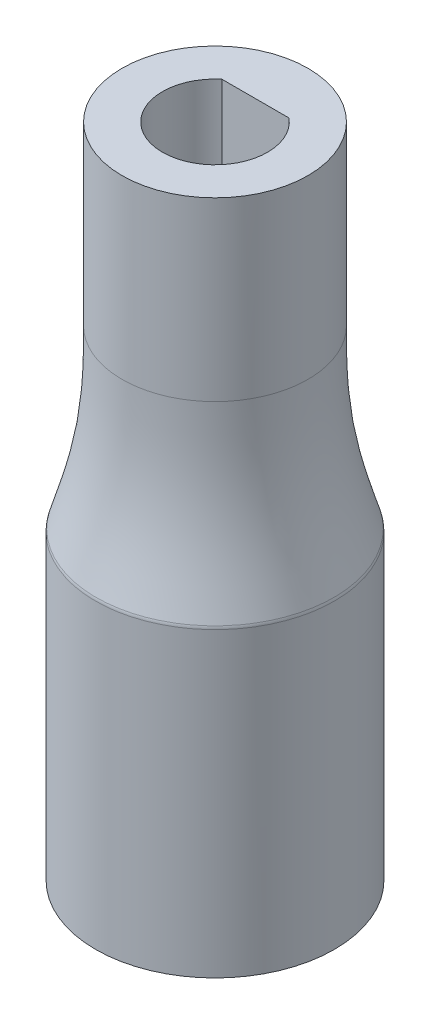
ISO-10303-21;
HEADER;
FILE_DESCRIPTION(('STEP AP214'),'2;1');
FILE_NAME('part.step','',(''),(''),'','','');
FILE_SCHEMA(('AUTOMOTIVE_DESIGN { 1 0 10303 214 1 1 1 1 }'));
ENDSEC;
DATA;
#1=APPLICATION_CONTEXT('core data for automotive mechanical design processes');
#2=APPLICATION_PROTOCOL_DEFINITION('international standard','automotive_design',2000,#1);
#3=PRODUCT_CONTEXT('',#1,'mechanical');
#4=PRODUCT('Part','Part','',(#3));
#5=PRODUCT_RELATED_PRODUCT_CATEGORY('part','',(#4));
#6=PRODUCT_DEFINITION_FORMATION('','',#4);
#7=PRODUCT_DEFINITION_CONTEXT('part definition',#1,'design');
#8=PRODUCT_DEFINITION('design','',#6,#7);
#9=PRODUCT_DEFINITION_SHAPE('','',#8);
#10=(LENGTH_UNIT() NAMED_UNIT(*) SI_UNIT(.MILLI.,.METRE.));
#11=(NAMED_UNIT(*) PLANE_ANGLE_UNIT() SI_UNIT($,.RADIAN.));
#12=(NAMED_UNIT(*) SI_UNIT($,.STERADIAN.) SOLID_ANGLE_UNIT());
#13=UNCERTAINTY_MEASURE_WITH_UNIT(LENGTH_MEASURE(1.E-05),#10,'distance_accuracy_value','');
#14=(GEOMETRIC_REPRESENTATION_CONTEXT(3) GLOBAL_UNCERTAINTY_ASSIGNED_CONTEXT((#13)) GLOBAL_UNIT_ASSIGNED_CONTEXT((#10,
#11,#12)) REPRESENTATION_CONTEXT('',''));
#15=CARTESIAN_POINT('',(0.,0.,0.));
#16=DIRECTION('',(0.,0.,1.));
#17=DIRECTION('',(1.,0.,0.));
#18=AXIS2_PLACEMENT_3D('',#15,#16,#17);
#19=CARTESIAN_POINT('',(0.,15.,0.));
#20=DIRECTION('',(0.,1.,0.));
#21=DIRECTION('',(0.,0.,1.));
#22=AXIS2_PLACEMENT_3D('',#19,#20,#21);
#23=PLANE('',#22);
#24=CARTESIAN_POINT('',(0.,15.,0.));
#25=DIRECTION('',(0.,1.,0.));
#26=DIRECTION('',(0.,0.,1.));
#27=AXIS2_PLACEMENT_3D('',#24,#25,#26);
#28=CIRCLE('',#27,4.6);
#29=CARTESIAN_POINT('',(0.,15.,4.6));
#30=VERTEX_POINT('',#29);
#31=EDGE_CURVE('E81',#30,#30,#28,.T.);
#32=ORIENTED_EDGE('',*,*,#31,.T.);
#33=EDGE_LOOP('',(#32));
#34=FACE_BOUND('',#33,.T.);
#35=DIRECTION('',(1.,0.,0.));
#36=VECTOR('',#35,1.);
#37=CARTESIAN_POINT('',(0.,15.,-2.));
#38=LINE('',#37,#36);
#39=CARTESIAN_POINT('',(-1.66132477258361,15.,-2.));
#40=VERTEX_POINT('',#39);
#41=CARTESIAN_POINT('',(1.66132477258361,15.,-2.));
#42=VERTEX_POINT('',#41);
#43=EDGE_CURVE('E58',#40,#42,#38,.T.);
#44=ORIENTED_EDGE('',*,*,#43,.T.);
#45=CARTESIAN_POINT('',(0.,15.,0.));
#46=DIRECTION('',(0.,1.,0.));
#47=DIRECTION('',(0.,0.,1.));
#48=AXIS2_PLACEMENT_3D('',#45,#46,#47);
#49=CIRCLE('',#48,2.6);
#50=EDGE_CURVE('E75',#40,#42,#49,.T.);
#51=ORIENTED_EDGE('',*,*,#50,.F.);
#52=EDGE_LOOP('',(#44,#51));
#53=FACE_BOUND('',#52,.T.);
#54=ADVANCED_FACE('F37',(#34,#53),#23,.T.);
#55=CARTESIAN_POINT('',(0.,15.,0.));
#56=DIRECTION('',(0.,-1.,0.));
#57=DIRECTION('',(0.,0.,-1.));
#58=AXIS2_PLACEMENT_3D('',#55,#56,#57);
#59=CYLINDRICAL_SURFACE('',#58,4.6);
#60=CARTESIAN_POINT('',(0.,6.26834648038043,-4.6));
#61=CARTESIAN_POINT('',(0.602057564036324,6.26834648038043,-4.6));
#62=CARTESIAN_POINT('',(1.80617269210897,6.26834648038041,-4.36048660927741));
#63=CARTESIAN_POINT('',(3.33737196484058,6.26834648038044,-3.33737196484058));
#64=CARTESIAN_POINT('',(4.36048660927742,6.26834648038043,-1.80617269210897));
#65=CARTESIAN_POINT('',(4.71975669536129,6.26834648038043,0.));
#66=CARTESIAN_POINT('',(4.36048660927741,6.26834648038043,1.80617269210898));
#67=CARTESIAN_POINT('',(3.33737196484058,6.26834648038044,3.33737196484058));
#68=CARTESIAN_POINT('',(1.80617269210899,6.26834648038043,4.36048660927741));
#69=CARTESIAN_POINT('',(0.,6.26834648038044,4.71975669536129));
#70=CARTESIAN_POINT('',(-1.80617269210895,6.26834648038042,4.36048660927741));
#71=CARTESIAN_POINT('',(-3.33737196484059,6.26834648038043,3.33737196484058));
#72=CARTESIAN_POINT('',(-4.3604866092774,6.26834648038042,1.80617269210899));
#73=CARTESIAN_POINT('',(-4.7197566953613,6.26834648038044,0.));
#74=CARTESIAN_POINT('',(-4.36048660927741,6.26834648038042,-1.80617269210896));
#75=CARTESIAN_POINT('',(-3.3373719648406,6.26834648038044,-3.33737196484058));
#76=CARTESIAN_POINT('',(-1.80617269210897,6.26834648038042,-4.36048660927741));
#77=CARTESIAN_POINT('',(-0.602057564036324,6.26834648038044,-4.6));
#78=CARTESIAN_POINT('',(0.,6.26834648038043,-4.6));
#79=B_SPLINE_CURVE_WITH_KNOTS('',3,(#60,#61,#62,#63,#64,#65,#66,#67,#68,#69,#70,#71,#72,#73,#74,
#75,#76,#77,#78),.UNSPECIFIED.,.T.,.F.,(4,1,1,1,1,1,1,1,1,1,1,1,1,1,1,1,4),(0.,
0.392699081698724,0.785398163397448,1.17809724509617,1.5707963267949,1.96349540849362,
2.35619449019234,2.74889357189107,3.14159265358979,3.53429173528852,3.92699081698724,
4.31968989868597,4.71238898038469,5.10508806208341,5.49778714378214,5.89048622548086,
6.28318530717959),.UNSPECIFIED.);
#80=CARTESIAN_POINT('',(0.,6.26834648038043,-4.6));
#81=VERTEX_POINT('',#80);
#82=EDGE_CURVE('E84',#81,#81,#79,.F.);
#83=ORIENTED_EDGE('',*,*,#82,.T.);
#84=EDGE_LOOP('',(#83));
#85=FACE_BOUND('',#84,.T.);
#86=ORIENTED_EDGE('',*,*,#31,.F.);
#87=EDGE_LOOP('',(#86));
#88=FACE_BOUND('',#87,.T.);
#89=ADVANCED_FACE('F97',(#85,#88),#59,.T.);
#90=CARTESIAN_POINT('',(0.,21.9426219830839,-2.));
#91=DIRECTION('',(0.,0.,-1.));
#92=DIRECTION('',(-1.,0.,0.));
#93=AXIS2_PLACEMENT_3D('',#90,#91,#92);
#94=PLANE('',#93);
#95=DIRECTION('',(0.,-1.,0.));
#96=VECTOR('',#95,1.);
#97=CARTESIAN_POINT('',(1.66132477258361,21.9426219830839,-2.));
#98=LINE('',#97,#96);
#99=CARTESIAN_POINT('',(1.66132477258361,0.,-2.));
#100=VERTEX_POINT('',#99);
#101=EDGE_CURVE('E76',#42,#100,#98,.T.);
#102=ORIENTED_EDGE('',*,*,#101,.F.);
#103=ORIENTED_EDGE('',*,*,#43,.F.);
#104=DIRECTION('',(0.,-1.,0.));
#105=VECTOR('',#104,1.);
#106=CARTESIAN_POINT('',(-1.66132477258361,21.9426219830839,-2.));
#107=LINE('',#106,#105);
#108=CARTESIAN_POINT('',(-1.66132477258361,0.,-2.));
#109=VERTEX_POINT('',#108);
#110=EDGE_CURVE('E66',#40,#109,#107,.T.);
#111=ORIENTED_EDGE('',*,*,#110,.T.);
#112=DIRECTION('',(1.,0.,0.));
#113=VECTOR('',#112,1.);
#114=CARTESIAN_POINT('',(0.,0.,-2.));
#115=LINE('',#114,#113);
#116=EDGE_CURVE('E70',#100,#109,#115,.F.);
#117=ORIENTED_EDGE('',*,*,#116,.F.);
#118=EDGE_LOOP('',(#102,#103,#111,#117));
#119=FACE_BOUND('',#118,.T.);
#120=ADVANCED_FACE('F68',(#119),#94,.F.);
#121=CARTESIAN_POINT('',(0.,21.9426219830839,0.));
#122=DIRECTION('',(0.,-1.,0.));
#123=DIRECTION('',(0.,0.,-1.));
#124=AXIS2_PLACEMENT_3D('',#121,#122,#123);
#125=CYLINDRICAL_SURFACE('',#124,2.6);
#126=CARTESIAN_POINT('',(0.,0.,0.));
#127=DIRECTION('',(0.,-1.,0.));
#128=DIRECTION('',(0.,0.,-1.));
#129=AXIS2_PLACEMENT_3D('',#126,#127,#128);
#130=CIRCLE('',#129,2.6);
#131=EDGE_CURVE('E78',#100,#109,#130,.T.);
#132=ORIENTED_EDGE('',*,*,#131,.T.);
#133=ORIENTED_EDGE('',*,*,#110,.F.);
#134=ORIENTED_EDGE('',*,*,#50,.T.);
#135=ORIENTED_EDGE('',*,*,#101,.T.);
#136=EDGE_LOOP('',(#132,#133,#134,#135));
#137=FACE_BOUND('',#136,.T.);
#138=ADVANCED_FACE('F79',(#137),#125,.F.);
#139=CARTESIAN_POINT('',(0.,0.,0.));
#140=DIRECTION('',(0.,1.,0.));
#141=DIRECTION('',(0.,0.,1.));
#142=AXIS2_PLACEMENT_3D('',#139,#140,#141);
#143=PLANE('',#142);
#144=ORIENTED_EDGE('',*,*,#131,.F.);
#145=ORIENTED_EDGE('',*,*,#116,.T.);
#146=EDGE_LOOP('',(#144,#145));
#147=FACE_BOUND('',#146,.T.);
#148=ADVANCED_FACE('F83',(#147),#143,.T.);
#149=CARTESIAN_POINT('',(0.,-17.5,0.));
#150=DIRECTION('',(0.,-1.,0.));
#151=DIRECTION('',(0.,0.,-1.));
#152=AXIS2_PLACEMENT_3D('',#149,#150,#151);
#153=PLANE('',#152);
#154=CARTESIAN_POINT('',(0.,-17.5,0.));
#155=DIRECTION('',(0.,-1.,0.));
#156=DIRECTION('',(0.,0.,-1.));
#157=AXIS2_PLACEMENT_3D('',#154,#155,#156);
#158=CIRCLE('',#157,5.91);
#159=CARTESIAN_POINT('',(0.,-17.5,-5.91));
#160=VERTEX_POINT('',#159);
#161=EDGE_CURVE('E172',#160,#160,#158,.T.);
#162=ORIENTED_EDGE('',*,*,#161,.T.);
#163=EDGE_LOOP('',(#162));
#164=FACE_BOUND('',#163,.T.);
#165=CARTESIAN_POINT('',(0.,-17.5,0.));
#166=DIRECTION('',(0.,-1.,0.));
#167=DIRECTION('',(0.,0.,-1.));
#168=AXIS2_PLACEMENT_3D('',#165,#166,#167);
#169=CIRCLE('',#168,3.91);
#170=CARTESIAN_POINT('',(0.,-17.5,-3.91));
#171=VERTEX_POINT('',#170);
#172=EDGE_CURVE('E176',#171,#171,#169,.T.);
#173=ORIENTED_EDGE('',*,*,#172,.F.);
#174=EDGE_LOOP('',(#173));
#175=FACE_BOUND('',#174,.T.);
#176=ADVANCED_FACE('F154',(#164,#175),#153,.T.);
#177=CARTESIAN_POINT('',(0.,-17.5,0.));
#178=DIRECTION('',(0.,1.,0.));
#179=DIRECTION('',(0.,0.,1.));
#180=AXIS2_PLACEMENT_3D('',#177,#178,#179);
#181=CYLINDRICAL_SURFACE('',#180,5.91);
#182=CARTESIAN_POINT('',(-2.92517746136589E-13,-2.57469509963466,-5.91000000000001));
#183=CARTESIAN_POINT('',(-0.773688017048747,-2.57469706030188,-5.90997909126028));
#184=CARTESIAN_POINT('',(-2.32199584157215,-2.57469313781378,-5.60208591121086));
#185=CARTESIAN_POINT('',(-4.29074686573459,-2.57469907406329,-4.28505561959482));
#186=CARTESIAN_POINT('',(-5.60339758448599,-2.57468141404342,-2.31731539786197));
#187=CARTESIAN_POINT('',(-6.06365367761534,-2.57474608352765,0.00181288145701384));
#188=CARTESIAN_POINT('',(-5.60198608884722,-2.57450491913344,2.32077000499834));
#189=CARTESIAN_POINT('',(-4.36146049960754,-2.57535484408724,4.1774887170232));
#190=CARTESIAN_POINT('',(-2.76611293005439,-2.57285180444992,5.32106483891855));
#191=CARTESIAN_POINT('',(-1.28843024631444,-2.57725914300339,5.82033576015936));
#192=CARTESIAN_POINT('',(-0.00937922713391973,-2.57353289222806,5.94859722248623));
#193=CARTESIAN_POINT('',(1.16851492406976,-2.57715303806135,5.83243691021282));
#194=CARTESIAN_POINT('',(2.27370102481877,-2.57346612624501,5.49622144947536));
#195=CARTESIAN_POINT('',(3.31049651187814,-2.57715306536371,4.941845959844));
#196=CARTESIAN_POINT('',(4.20418870143708,-2.57353275026773,4.20736516458198));
#197=CARTESIAN_POINT('',(5.03094276132681,-2.57725917680259,3.20050113660957));
#198=CARTESIAN_POINT('',(5.71758749823191,-2.57285179837777,1.80471570834589));
#199=CARTESIAN_POINT('',(6.03858871181564,-2.5753549158269,-0.134038935673405));
#200=CARTESIAN_POINT('',(5.60061021288667,-2.57450496100534,-2.32355048687747));
#201=CARTESIAN_POINT('',(4.28626225319125,-2.57474608619252,-4.28911422356737));
#202=CARTESIAN_POINT('',(2.32013226071858,-2.57468137381047,-5.60221136364924));
#203=CARTESIAN_POINT('',(0.773688017048162,-2.57469313896744,-5.91002090873974));
#204=CARTESIAN_POINT('',(-2.93710368526323E-13,-2.57469509963466,-5.91000000000001));
#205=B_SPLINE_CURVE_WITH_KNOTS('',3,(#182,#183,#184,#185,#186,#187,#188,#189,#190,#191,#192,
#193,#194,#195,#196,#197,#198,#199,#200,#201,#202,#203,#204),.UNSPECIFIED.,.T.,.F.,(4,1,1,1,1,1,
1,1,1,1,1,1,1,1,1,1,1,1,1,1,4),(0.000321343405563439,0.00243573738021137,0.00455013135485931,
0.00666452532950724,0.00877891930415518,0.0108933132788031,0.013007707253451,0.0147697022323243,
0.0161792982154229,0.0172364952027469,0.0182936921900709,0.0193508891773949,0.0204080861647188,
0.0214652831520428,0.0225224801393668,0.0239320761224654,0.0256940711013387,0.0278084650759866,
0.0299228590506345,0.0320372530252825,0.0341516469999304),.UNSPECIFIED.);
#206=CARTESIAN_POINT('',(-2.92517746136589E-13,-2.57469509963466,-5.91000000000001));
#207=VERTEX_POINT('',#206);
#208=EDGE_CURVE('E52',#207,#207,#205,.F.);
#209=ORIENTED_EDGE('',*,*,#208,.T.);
#210=EDGE_LOOP('',(#209));
#211=FACE_BOUND('',#210,.T.);
#212=ORIENTED_EDGE('',*,*,#161,.F.);
#213=EDGE_LOOP('',(#212));
#214=FACE_BOUND('',#213,.T.);
#215=ADVANCED_FACE('F143',(#211,#214),#181,.T.);
#216=CARTESIAN_POINT('',(0.,-17.5,0.));
#217=DIRECTION('',(0.,1.,0.));
#218=DIRECTION('',(0.,0.,1.));
#219=AXIS2_PLACEMENT_3D('',#216,#217,#218);
#220=CYLINDRICAL_SURFACE('',#219,3.91);
#221=ORIENTED_EDGE('',*,*,#172,.T.);
#222=EDGE_LOOP('',(#221));
#223=FACE_BOUND('',#222,.T.);
#224=CARTESIAN_POINT('',(0.,-2.5,0.));
#225=DIRECTION('',(0.,-1.,0.));
#226=DIRECTION('',(0.,0.,-1.));
#227=AXIS2_PLACEMENT_3D('',#224,#225,#226);
#228=CIRCLE('',#227,3.91);
#229=CARTESIAN_POINT('',(0.,-2.5,-3.91));
#230=VERTEX_POINT('',#229);
#231=EDGE_CURVE('E180',#230,#230,#228,.T.);
#232=ORIENTED_EDGE('',*,*,#231,.F.);
#233=EDGE_LOOP('',(#232));
#234=FACE_BOUND('',#233,.T.);
#235=ADVANCED_FACE('F153',(#223,#234),#220,.F.);
#236=CARTESIAN_POINT('',(0.,-2.5,0.));
#237=DIRECTION('',(0.,1.,0.));
#238=DIRECTION('',(0.,0.,1.));
#239=AXIS2_PLACEMENT_3D('',#236,#237,#238);
#240=PLANE('',#239);
#241=ORIENTED_EDGE('',*,*,#231,.T.);
#242=EDGE_LOOP('',(#241));
#243=FACE_BOUND('',#242,.T.);
#244=ADVANCED_FACE('F115',(#243),#240,.F.);
#245=CARTESIAN_POINT('',(0.,-2.5,-5.91));
#246=CARTESIAN_POINT('',(0.773513087707539,-2.5,-5.91));
#247=CARTESIAN_POINT('',(2.32053926312261,-2.5,-5.60227736104988));
#248=CARTESIAN_POINT('',(4.28779745917562,-2.5,-4.28779745917563));
#249=CARTESIAN_POINT('',(5.60227736104989,-2.5,-2.32053926312261));
#250=CARTESIAN_POINT('',(6.06386131947506,-2.5,0.));
#251=CARTESIAN_POINT('',(5.60227736104989,-2.5,2.32053926312262));
#252=CARTESIAN_POINT('',(4.28779745917561,-2.5,4.28779745917563));
#253=CARTESIAN_POINT('',(2.32053926312263,-2.5,5.60227736104988));
#254=CARTESIAN_POINT('',(0.,-2.5,6.06386131947506));
#255=CARTESIAN_POINT('',(-2.3205392631226,-2.5,5.6022773610499));
#256=CARTESIAN_POINT('',(-4.28779745917563,-2.5,4.28779745917561));
#257=CARTESIAN_POINT('',(-5.60227736104987,-2.5,2.32053926312263));
#258=CARTESIAN_POINT('',(-6.06386131947507,-2.5,0.));
#259=CARTESIAN_POINT('',(-5.60227736104989,-2.5,-2.3205392631226));
#260=CARTESIAN_POINT('',(-4.28779745917564,-2.5,-4.28779745917561));
#261=CARTESIAN_POINT('',(-2.32053926312262,-2.50000000000001,-5.60227736104988));
#262=CARTESIAN_POINT('',(-0.773513087707539,-2.5,-5.91));
#263=CARTESIAN_POINT('',(0.,-2.5,-5.91));
#264=CARTESIAN_POINT('',(0.,-1.69897702874171,-5.66518832517475));
#265=CARTESIAN_POINT('',(0.741471626709072,-1.69897702874172,-5.66518832517475));
#266=CARTESIAN_POINT('',(2.22441488012721,-1.6989770287417,-5.37021257194764));
#267=CARTESIAN_POINT('',(4.11018275912617,-1.69897702874172,-4.11018275912618));
#268=CARTESIAN_POINT('',(5.37021257194765,-1.6989770287417,-2.22441488012721));
#269=CARTESIAN_POINT('',(5.8126762017883,-1.69897702874173,0.));
#270=CARTESIAN_POINT('',(5.37021257194764,-1.69897702874168,2.22441488012722));
#271=CARTESIAN_POINT('',(4.11018275912617,-1.69897702874173,4.11018275912618));
#272=CARTESIAN_POINT('',(2.22441488012723,-1.69897702874173,5.37021257194764));
#273=CARTESIAN_POINT('',(0.,-1.69897702874172,5.8126762017883));
#274=CARTESIAN_POINT('',(-2.2244148801272,-1.69897702874169,5.37021257194765));
#275=CARTESIAN_POINT('',(-4.11018275912619,-1.69897702874174,4.11018275912616));
#276=CARTESIAN_POINT('',(-5.37021257194764,-1.69897702874173,2.22441488012724));
#277=CARTESIAN_POINT('',(-5.8126762017883,-1.69897702874172,0.));
#278=CARTESIAN_POINT('',(-5.37021257194765,-1.69897702874169,-2.2244148801272));
#279=CARTESIAN_POINT('',(-4.11018275912619,-1.69897702874174,-4.11018275912617));
#280=CARTESIAN_POINT('',(-2.22441488012721,-1.69897702874169,-5.37021257194764));
#281=CARTESIAN_POINT('',(-0.741471626709072,-1.69897702874171,-5.66518832517475));
#282=CARTESIAN_POINT('',(0.,-1.69897702874171,-5.66518832517475));
#283=CARTESIAN_POINT('',(0.,-0.89795405748343,-5.4203766503495));
#284=CARTESIAN_POINT('',(0.709430165710605,-0.897954057483434,-5.4203766503495));
#285=CARTESIAN_POINT('',(2.12829049713182,-0.897954057483392,-5.1381477828454));
#286=CARTESIAN_POINT('',(3.93256805907672,-0.897954057483451,-3.93256805907673));
#287=CARTESIAN_POINT('',(5.13814778284542,-0.897954057483408,-2.12829049713181));
#288=CARTESIAN_POINT('',(5.56149108410154,-0.897954057483455,0.));
#289=CARTESIAN_POINT('',(5.1381477828454,-0.897954057483351,2.12829049713182));
#290=CARTESIAN_POINT('',(3.93256805907672,-0.897954057483452,3.93256805907673));
#291=CARTESIAN_POINT('',(2.12829049713184,-0.897954057483455,5.13814778284541));
#292=CARTESIAN_POINT('',(0.,-0.897954057483438,5.56149108410154));
#293=CARTESIAN_POINT('',(-2.12829049713179,-0.89795405748337,5.13814778284541));
#294=CARTESIAN_POINT('',(-3.93256805907674,-0.897954057483486,3.93256805907672));
#295=CARTESIAN_POINT('',(-5.13814778284541,-0.897954057483465,2.12829049713184));
#296=CARTESIAN_POINT('',(-5.56149108410154,-0.897954057483434,0.));
#297=CARTESIAN_POINT('',(-5.13814778284541,-0.897954057483382,-2.1282904971318));
#298=CARTESIAN_POINT('',(-3.93256805907674,-0.897954057483473,-3.93256805907672));
#299=CARTESIAN_POINT('',(-2.12829049713181,-0.897954057483367,-5.13814778284539));
#300=CARTESIAN_POINT('',(-0.709430165710605,-0.897954057483426,-5.4203766503495));
#301=CARTESIAN_POINT('',(0.,-0.89795405748343,-5.4203766503495));
#302=CARTESIAN_POINT('',(0.,0.89990284863434,-4.92930738927721));
#303=CARTESIAN_POINT('',(0.645157999820543,0.899902848634354,-4.92930738927721));
#304=CARTESIAN_POINT('',(1.93547399946162,0.899902848634346,-4.67264757912075));
#305=CARTESIAN_POINT('',(3.57628962762072,0.899902848634294,-3.57628962762072));
#306=CARTESIAN_POINT('',(4.67264757912075,0.899902848634383,-1.93547399946162));
#307=CARTESIAN_POINT('',(5.05763729435544,0.899902848634315,0.));
#308=CARTESIAN_POINT('',(4.67264757912074,0.899902848634394,1.93547399946163));
#309=CARTESIAN_POINT('',(3.57628962762071,0.899902848634333,3.57628962762072));
#310=CARTESIAN_POINT('',(1.93547399946164,0.899902848634225,4.67264757912076));
#311=CARTESIAN_POINT('',(0.,0.899902848634363,5.05763729435543));
#312=CARTESIAN_POINT('',(-1.9354739994616,0.899902848634363,4.67264757912075));
#313=CARTESIAN_POINT('',(-3.57628962762073,0.899902848634308,3.57628962762071));
#314=CARTESIAN_POINT('',(-4.67264757912074,0.899902848634291,1.93547399946164));
#315=CARTESIAN_POINT('',(-5.05763729435544,0.899902848634371,0.));
#316=CARTESIAN_POINT('',(-4.67264757912076,0.899902848634263,-1.93547399946161));
#317=CARTESIAN_POINT('',(-3.57628962762072,0.899902848634396,-3.5762896276207));
#318=CARTESIAN_POINT('',(-1.93547399946163,0.89990284863426,-4.67264757912076));
#319=CARTESIAN_POINT('',(-0.645157999820542,0.899902848634325,-4.92930738927721));
#320=CARTESIAN_POINT('',(0.,0.89990284863434,-4.92930738927721));
#321=CARTESIAN_POINT('',(0.,2.73027096941762,-4.65584850582738));
#322=CARTESIAN_POINT('',(0.609367132595781,2.73027096941763,-4.65584850582738));
#323=CARTESIAN_POINT('',(1.82810139778734,2.7302709694176,-4.41342718793142));
#324=CARTESIAN_POINT('',(3.377890929542,2.73027096941759,-3.37789092954201));
#325=CARTESIAN_POINT('',(4.41342718793142,2.73027096941765,-1.82810139778734));
#326=CARTESIAN_POINT('',(4.77705916477536,2.73027096941761,0.));
#327=CARTESIAN_POINT('',(4.41342718793141,2.73027096941765,1.82810139778734));
#328=CARTESIAN_POINT('',(3.37789092954199,2.73027096941763,3.377890929542));
#329=CARTESIAN_POINT('',(1.82810139778736,2.73027096941752,4.41342718793142));
#330=CARTESIAN_POINT('',(0.,2.73027096941765,4.77705916477535));
#331=CARTESIAN_POINT('',(-1.82810139778732,2.73027096941761,4.41342718793142));
#332=CARTESIAN_POINT('',(-3.37789092954202,2.73027096941761,3.377890929542));
#333=CARTESIAN_POINT('',(-4.41342718793141,2.73027096941759,1.82810139778736));
#334=CARTESIAN_POINT('',(-4.77705916477536,2.73027096941765,0.));
#335=CARTESIAN_POINT('',(-4.41342718793142,2.73027096941754,-1.82810139778733));
#336=CARTESIAN_POINT('',(-3.37789092954202,2.73027096941766,-3.37789092954199));
#337=CARTESIAN_POINT('',(-1.82810139778735,2.73027096941753,-4.41342718793142));
#338=CARTESIAN_POINT('',(-0.609367132595781,2.73027096941761,-4.65584850582738));
#339=CARTESIAN_POINT('',(0.,2.73027096941762,-4.65584850582738));
#340=CARTESIAN_POINT('',(0.,4.59315030486641,-4.6));
#341=CARTESIAN_POINT('',(0.602057564036324,4.5931503048664,-4.6));
#342=CARTESIAN_POINT('',(1.80617269210897,4.59315030486637,-4.36048660927741));
#343=CARTESIAN_POINT('',(3.33737196484058,4.59315030486643,-3.33737196484058));
#344=CARTESIAN_POINT('',(4.36048660927742,4.59315030486639,-1.80617269210897));
#345=CARTESIAN_POINT('',(4.71975669536129,4.59315030486642,0.));
#346=CARTESIAN_POINT('',(4.36048660927741,4.59315030486641,1.80617269210898));
#347=CARTESIAN_POINT('',(3.33737196484057,4.59315030486643,3.33737196484058));
#348=CARTESIAN_POINT('',(1.80617269210899,4.59315030486642,4.3604866092774));
#349=CARTESIAN_POINT('',(0.,4.59315030486642,4.71975669536129));
#350=CARTESIAN_POINT('',(-1.80617269210896,4.59315030486637,4.36048660927742));
#351=CARTESIAN_POINT('',(-3.3373719648406,4.59315030486639,3.33737196484058));
#352=CARTESIAN_POINT('',(-4.3604866092774,4.59315030486642,1.80617269210899));
#353=CARTESIAN_POINT('',(-4.7197566953613,4.59315030486641,0.));
#354=CARTESIAN_POINT('',(-4.3604866092774,4.59315030486643,-1.80617269210895));
#355=CARTESIAN_POINT('',(-3.3373719648406,4.59315030486633,-3.33737196484058));
#356=CARTESIAN_POINT('',(-1.80617269210897,4.59315030486644,-4.36048660927741));
#357=CARTESIAN_POINT('',(-0.602057564036324,4.59315030486643,-4.6));
#358=CARTESIAN_POINT('',(0.,4.59315030486641,-4.6));
#359=CARTESIAN_POINT('',(0.,5.43074839262343,-4.6));
#360=CARTESIAN_POINT('',(0.602057564036325,5.43074839262342,-4.6));
#361=CARTESIAN_POINT('',(1.80617269210897,5.43074839262339,-4.36048660927741));
#362=CARTESIAN_POINT('',(3.33737196484058,5.43074839262344,-3.33737196484058));
#363=CARTESIAN_POINT('',(4.36048660927742,5.43074839262342,-1.80617269210897));
#364=CARTESIAN_POINT('',(4.71975669536129,5.43074839262343,0.));
#365=CARTESIAN_POINT('',(4.36048660927741,5.43074839262342,1.80617269210898));
#366=CARTESIAN_POINT('',(3.33737196484058,5.43074839262344,3.33737196484058));
#367=CARTESIAN_POINT('',(1.80617269210899,5.43074839262343,4.36048660927741));
#368=CARTESIAN_POINT('',(0.,5.43074839262343,4.71975669536129));
#369=CARTESIAN_POINT('',(-1.80617269210896,5.43074839262339,4.36048660927741));
#370=CARTESIAN_POINT('',(-3.33737196484059,5.43074839262341,3.33737196484058));
#371=CARTESIAN_POINT('',(-4.3604866092774,5.43074839262342,1.80617269210899));
#372=CARTESIAN_POINT('',(-4.7197566953613,5.43074839262343,0.));
#373=CARTESIAN_POINT('',(-4.36048660927741,5.43074839262343,-1.80617269210896));
#374=CARTESIAN_POINT('',(-3.3373719648406,5.43074839262339,-3.33737196484057));
#375=CARTESIAN_POINT('',(-1.80617269210897,5.43074839262343,-4.36048660927741));
#376=CARTESIAN_POINT('',(-0.602057564036324,5.43074839262343,-4.6));
#377=CARTESIAN_POINT('',(0.,5.43074839262343,-4.6));
#378=CARTESIAN_POINT('',(0.,6.26834648038044,-4.6));
#379=CARTESIAN_POINT('',(0.602057564036324,6.26834648038044,-4.6));
#380=CARTESIAN_POINT('',(1.80617269210897,6.26834648038041,-4.36048660927741));
#381=CARTESIAN_POINT('',(3.33737196484058,6.26834648038045,-3.33737196484058));
#382=CARTESIAN_POINT('',(4.36048660927742,6.26834648038044,-1.80617269210897));
#383=CARTESIAN_POINT('',(4.71975669536129,6.26834648038044,0.));
#384=CARTESIAN_POINT('',(4.36048660927741,6.26834648038043,1.80617269210898));
#385=CARTESIAN_POINT('',(3.33737196484058,6.26834648038045,3.33737196484058));
#386=CARTESIAN_POINT('',(1.80617269210899,6.26834648038043,4.36048660927741));
#387=CARTESIAN_POINT('',(0.,6.26834648038044,4.71975669536129));
#388=CARTESIAN_POINT('',(-1.80617269210895,6.26834648038042,4.36048660927741));
#389=CARTESIAN_POINT('',(-3.33737196484059,6.26834648038043,3.33737196484058));
#390=CARTESIAN_POINT('',(-4.3604866092774,6.26834648038042,1.80617269210899));
#391=CARTESIAN_POINT('',(-4.7197566953613,6.26834648038045,0.));
#392=CARTESIAN_POINT('',(-4.36048660927741,6.26834648038043,-1.80617269210896));
#393=CARTESIAN_POINT('',(-3.3373719648406,6.26834648038045,-3.33737196484058));
#394=CARTESIAN_POINT('',(-1.80617269210897,6.26834648038042,-4.36048660927741));
#395=CARTESIAN_POINT('',(-0.602057564036324,6.26834648038044,-4.6));
#396=CARTESIAN_POINT('',(0.,6.26834648038044,-4.6));
#397=B_SPLINE_SURFACE_WITH_KNOTS('',5,3,((#245,#246,#247,#248,#249,#250,#251,#252,#253,#254,
#255,#256,#257,#258,#259,#260,#261,#262,#263),(#264,#265,#266,#267,#268,#269,#270,#271,#272,
#273,#274,#275,#276,#277,#278,#279,#280,#281,#282),(#283,#284,#285,#286,#287,#288,#289,#290,
#291,#292,#293,#294,#295,#296,#297,#298,#299,#300,#301),(#302,#303,#304,#305,#306,#307,#308,
#309,#310,#311,#312,#313,#314,#315,#316,#317,#318,#319,#320),(#321,#322,#323,#324,#325,#326,
#327,#328,#329,#330,#331,#332,#333,#334,#335,#336,#337,#338,#339),(#340,#341,#342,#343,#344,
#345,#346,#347,#348,#349,#350,#351,#352,#353,#354,#355,#356,#357,#358),(#359,#360,#361,#362,
#363,#364,#365,#366,#367,#368,#369,#370,#371,#372,#373,#374,#375,#376,#377),(#378,#379,#380,
#381,#382,#383,#384,#385,#386,#387,#388,#389,#390,#391,#392,#393,#394,#395,#396)),.UNSPECIFIED.,
.F.,.T.,.F.,(6,2,6),(4,1,1,1,1,1,1,1,1,1,1,1,1,1,1,1,4),(0.,0.5,1.),(0.,0.392699081698724,
0.785398163397448,1.17809724509617,1.5707963267949,1.96349540849362,2.35619449019234,
2.74889357189107,3.14159265358979,3.53429173528852,3.92699081698724,4.31968989868597,
4.71238898038469,5.10508806208341,5.49778714378214,5.89048622548086,6.28318530717959),.UNSPECIFIED.);
#398=CARTESIAN_POINT('',(0.,-2.42858637024878,-5.88817595004061));
#399=CARTESIAN_POINT('',(-0.770656710673635,-2.42858637024878,-5.88817595004061));
#400=CARTESIAN_POINT('',(-2.31197013202091,-2.42858637024878,-5.58158964852638));
#401=CARTESIAN_POINT('',(-4.27196376950308,-2.42858637024878,-4.27196376950306));
#402=CARTESIAN_POINT('',(-5.58158964852638,-2.42858637024878,-2.31197013202089));
#403=CARTESIAN_POINT('',(-6.04146910079774,-2.42858637024877,0.));
#404=CARTESIAN_POINT('',(-5.58158964852637,-2.42858637024878,2.31197013202092));
#405=CARTESIAN_POINT('',(-4.27196376950308,-2.42858637024878,4.27196376950305));
#406=CARTESIAN_POINT('',(-2.31197013202089,-2.42858637024878,5.58158964852639));
#407=CARTESIAN_POINT('',(0.,-2.42858637024877,6.04146910079773));
#408=CARTESIAN_POINT('',(2.31197013202092,-2.42858637024878,5.58158964852637));
#409=CARTESIAN_POINT('',(4.27196376950306,-2.42858637024878,4.27196376950308));
#410=CARTESIAN_POINT('',(5.58158964852639,-2.42858637024878,2.31197013202091));
#411=CARTESIAN_POINT('',(6.04146910079773,-2.42858637024878,0.));
#412=CARTESIAN_POINT('',(5.58158964852639,-2.42858637024878,-2.3119701320209));
#413=CARTESIAN_POINT('',(4.27196376950307,-2.42858637024878,-4.27196376950307));
#414=CARTESIAN_POINT('',(2.3119701320209,-2.42858637024878,-5.58158964852638));
#415=CARTESIAN_POINT('',(0.770656710673636,-2.42858637024878,-5.88817595004061));
#416=CARTESIAN_POINT('',(0.,-2.42858637024878,-5.88817595004061));
#417=B_SPLINE_CURVE_WITH_KNOTS('',3,(#398,#399,#400,#401,#402,#403,#404,#405,#406,#407,#408,
#409,#410,#411,#412,#413,#414,#415,#416),.UNSPECIFIED.,.T.,.F.,(4,1,1,1,1,1,1,1,1,1,1,1,1,1,1,1,
4),(0.,0.392699081698724,0.785398163397448,1.17809724509617,1.5707963267949,1.96349540849362,
2.35619449019235,2.74889357189107,3.14159265358979,3.53429173528852,3.92699081698724,
4.31968989868597,4.71238898038469,5.10508806208341,5.49778714378214,5.89048622548086,
6.28318530717959),.UNSPECIFIED.);
#418=CARTESIAN_POINT('',(0.,-2.42858637024878,-5.88817595004061));
#419=VERTEX_POINT('',#418);
#420=EDGE_CURVE('E11',#419,#419,#417,.T.);
#421=ORIENTED_EDGE('',*,*,#420,.T.);
#422=EDGE_LOOP('',(#421));
#423=FACE_BOUND('',#422,.T.);
#424=ORIENTED_EDGE('',*,*,#82,.F.);
#425=EDGE_LOOP('',(#424));
#426=FACE_BOUND('',#425,.T.);
#427=ADVANCED_FACE('F108',(#423,#426),#397,.T.);
#428=CARTESIAN_POINT('',(-2.93710368526323E-13,-2.57469509963466,-5.91000000000001));
#429=CARTESIAN_POINT('',(0.773688017048162,-2.57469313896744,-5.91002090873974));
#430=CARTESIAN_POINT('',(2.32013226071858,-2.57468137381047,-5.60221136364924));
#431=CARTESIAN_POINT('',(4.28626225319125,-2.57474608619252,-4.28911422356737));
#432=CARTESIAN_POINT('',(5.60061021288667,-2.57450496100534,-2.32355048687747));
#433=CARTESIAN_POINT('',(6.03858871181564,-2.5753549158269,-0.134038935673405));
#434=CARTESIAN_POINT('',(5.71758749823191,-2.57285179837777,1.80471570834589));
#435=CARTESIAN_POINT('',(5.03094276132681,-2.57725917680259,3.20050113660957));
#436=CARTESIAN_POINT('',(4.20418870143708,-2.57353275026773,4.20736516458198));
#437=CARTESIAN_POINT('',(3.31049651187814,-2.57715306536371,4.941845959844));
#438=CARTESIAN_POINT('',(2.27370102481877,-2.57346612624501,5.49622144947536));
#439=CARTESIAN_POINT('',(1.16851492406976,-2.57715303806135,5.83243691021282));
#440=CARTESIAN_POINT('',(-0.00937922713391973,-2.57353289222806,5.94859722248623));
#441=CARTESIAN_POINT('',(-1.28843024631444,-2.57725914300339,5.82033576015936));
#442=CARTESIAN_POINT('',(-2.76611293005439,-2.57285180444992,5.32106483891855));
#443=CARTESIAN_POINT('',(-4.36146049960754,-2.57535484408724,4.1774887170232));
#444=CARTESIAN_POINT('',(-5.60198608884722,-2.57450491913344,2.32077000499834));
#445=CARTESIAN_POINT('',(-6.06365367761534,-2.57474608352765,0.00181288145701384));
#446=CARTESIAN_POINT('',(-5.60339758448599,-2.57468141404342,-2.31731539786197));
#447=CARTESIAN_POINT('',(-4.29074686573459,-2.57469907406329,-4.28505561959482));
#448=CARTESIAN_POINT('',(-2.32199584157215,-2.57469313781378,-5.60208591121086));
#449=CARTESIAN_POINT('',(-0.773688017048747,-2.57469706030188,-5.90997909126028));
#450=CARTESIAN_POINT('',(-2.93710368526323E-13,-2.57469509963466,-5.91000000000001));
#451=CARTESIAN_POINT('',(-2.93764578634947E-13,-2.56073814595453,-5.91000000000001));
#452=CARTESIAN_POINT('',(0.773688036886644,-2.5607361841032,-5.9100209117561));
#453=CARTESIAN_POINT('',(2.3201322180715,-2.56072441184085,-5.60221136069601));
#454=CARTESIAN_POINT('',(4.28626207327879,-2.56078916330496,-4.28911435337386));
#455=CARTESIAN_POINT('',(5.60061006480552,-2.56054789249421,-2.32355088038655));
#456=CARTESIAN_POINT('',(6.03858862669426,-2.56139836063253,-0.134039291638018));
#457=CARTESIAN_POINT('',(5.71758784062073,-2.55889373146533,1.80471510516332));
#458=CARTESIAN_POINT('',(5.03094250906635,-2.563303771656,3.20050149492931));
#459=CARTESIAN_POINT('',(4.20418889025109,-2.55957509460523,4.20736498097824));
#460=CARTESIAN_POINT('',(3.31049613265981,-2.56319759613286,4.94184622222656));
#461=CARTESIAN_POINT('',(2.2737012600859,-2.55950843034603,5.4962213147676));
#462=CARTESIAN_POINT('',(1.16851479068603,-2.56319756881383,5.83243700912554));
#463=CARTESIAN_POINT('',(-0.00938008527156226,-2.55957523665196,5.94859719227443));
#464=CARTESIAN_POINT('',(-1.28842981025797,-2.56330373783611,5.82033578487232));
#465=CARTESIAN_POINT('',(-2.766113057079,-2.55889373754128,5.32106489869453));
#466=CARTESIAN_POINT('',(-4.36146049852845,-2.56139828884918,4.17748865537406));
#467=CARTESIAN_POINT('',(-5.60198607716288,-2.56054785059685,2.32077001590969));
#468=CARTESIAN_POINT('',(-6.06365364910426,-2.56078916063846,0.00181308646799742));
#469=CARTESIAN_POINT('',(-5.60339770985645,-2.56072445209827,-2.31731504233739));
#470=CARTESIAN_POINT('',(-4.29074719130291,-2.5607421227837,-4.28505531595244));
#471=CARTESIAN_POINT('',(-2.32199600325012,-2.56073618294884,-5.60208589015944));
#472=CARTESIAN_POINT('',(-0.773688036887229,-2.56074010780587,-5.90997908824391));
#473=CARTESIAN_POINT('',(-2.93764578634947E-13,-2.56073814595453,-5.91000000000001));
#474=CARTESIAN_POINT('',(-2.93872998852196E-13,-2.54678119227441,-5.91000000000001));
#475=CARTESIAN_POINT('',(0.773688056725126,-2.54677922923896,-5.91002091477247));
#476=CARTESIAN_POINT('',(2.32013217542442,-2.54676744987124,-5.60221135774278));
#477=CARTESIAN_POINT('',(4.28626189336632,-2.54683224041735,-4.28911448318036));
#478=CARTESIAN_POINT('',(5.60060991672434,-2.54659082398288,-2.32355127389561));
#479=CARTESIAN_POINT('',(6.03858854157283,-2.54744180543785,-0.134039647602631));
#480=CARTESIAN_POINT('',(5.71758818300952,-2.54493566455282,1.80471450198075));
#481=CARTESIAN_POINT('',(5.03094225680588,-2.54934836650936,3.20050185324905));
#482=CARTESIAN_POINT('',(4.20418907906511,-2.54561743894275,4.20736479737451));
#483=CARTESIAN_POINT('',(3.31049575344147,-2.54924212690191,4.94184648460911));
#484=CARTESIAN_POINT('',(2.27370149535303,-2.54555073444704,5.49622118005983));
#485=CARTESIAN_POINT('',(1.1685146573023,-2.5492420995664,5.83243710803828));
#486=CARTESIAN_POINT('',(-0.00938094340920395,-2.54561758107517,5.94859716206253));
#487=CARTESIAN_POINT('',(-1.28842937420149,-2.54934833266909,5.82033580958532));
#488=CARTESIAN_POINT('',(-2.7661131841036,-2.54493567063242,5.32106495847047));
#489=CARTESIAN_POINT('',(-4.36146049744937,-2.5474417336112,4.17748859372493));
#490=CARTESIAN_POINT('',(-5.60198606547853,-2.54659078206025,2.32077002682104));
#491=CARTESIAN_POINT('',(-6.06365362059317,-2.54683223774925,0.00181329147897943));
#492=CARTESIAN_POINT('',(-5.60339783522687,-2.54676749015294,-2.3173146868128));
#493=CARTESIAN_POINT('',(-4.29074751687121,-2.54678517150385,-4.28505501231003));
#494=CARTESIAN_POINT('',(-2.3219961649281,-2.54677922808391,-5.60208586910802));
#495=CARTESIAN_POINT('',(-0.773688056725711,-2.54678315530986,-5.90997908522755));
#496=CARTESIAN_POINT('',(-2.93872998852196E-13,-2.54678119227441,-5.91000000000001));
#497=CARTESIAN_POINT('',(-2.94035629178069E-13,-2.51574215511199,-5.90906973433623));
#498=CARTESIAN_POINT('',(0.773566318068779,-2.51574018950088,-5.90909065261108));
#499=CARTESIAN_POINT('',(2.31976687846478,-2.51572839467761,-5.60132953372532));
#500=CARTESIAN_POINT('',(4.28558681585633,-2.51579327023449,-4.2884396399546));
#501=CARTESIAN_POINT('',(5.59972800925288,-2.51555153704174,-2.3231864184821));
#502=CARTESIAN_POINT('',(6.03763788803846,-2.51640363505605,-0.134019310432761));
#503=CARTESIAN_POINT('',(5.71668884825787,-2.51389420590327,1.80442900381831));
#504=CARTESIAN_POINT('',(5.03014996149574,-2.51831269769517,3.19999899218116));
#505=CARTESIAN_POINT('',(4.20352767541655,-2.5145768748382,4.20670206218767));
#506=CARTESIAN_POINT('',(3.30997392655543,-2.51820631869253,4.94106935552017));
#507=CARTESIAN_POINT('',(2.27334408964129,-2.51451008282068,5.49535565852507));
#508=CARTESIAN_POINT('',(1.16833046861807,-2.51820629132072,5.83151945978206));
#509=CARTESIAN_POINT('',(-0.00938137790782006,-2.51457701715873,5.9476606641755));
#510=CARTESIAN_POINT('',(-1.28822563034986,-2.51831266380981,5.81941991130034));
#511=CARTESIAN_POINT('',(-2.76567804268294,-2.51389421199114,5.32022738438082));
#512=CARTESIAN_POINT('',(-4.36077398600207,-2.51640356313432,4.17683094866744));
#513=CARTESIAN_POINT('',(-5.60110425450548,-2.51555149506367,2.32040473470965));
#514=CARTESIAN_POINT('',(-6.06269910624401,-2.51579326756286,0.00181346599989758));
#515=CARTESIAN_POINT('',(-5.60251610907605,-2.51572843501261,-2.31694913936095));
#516=CARTESIAN_POINT('',(-4.29007285439252,-2.51574613956308,-4.28437984603058));
#517=CARTESIAN_POINT('',(-2.32163102994965,-2.5157401883443,-5.60120402407619));
#518=CARTESIAN_POINT('',(-0.773566318069364,-2.51574412072311,-5.90904881606137));
#519=CARTESIAN_POINT('',(-2.94035629178069E-13,-2.51574215511199,-5.90906973433623));
#520=CARTESIAN_POINT('',(-2.94035629178069E-13,-2.48524009292285,-5.90451427394341));
#521=CARTESIAN_POINT('',(0.772969997796313,-2.48523812474689,-5.9045351831098));
#522=CARTESIAN_POINT('',(2.31797841037125,-2.48522631453306,-5.59701131513269));
#523=CARTESIAN_POINT('',(4.28228256402469,-2.48529127474342,-4.28513383946156));
#524=CARTESIAN_POINT('',(5.59541064565199,-2.4850492261246,-2.32139631565245));
#525=CARTESIAN_POINT('',(6.03298332923317,-2.48590243600399,-0.133916622560153));
#526=CARTESIAN_POINT('',(5.71228187744516,-2.48338973240828,1.80303618771616));
#527=CARTESIAN_POINT('',(5.0262723260864,-2.48781398969223,3.19753338662892));
#528=CARTESIAN_POINT('',(4.20028717569328,-2.48407329212682,4.2034582839567));
#529=CARTESIAN_POINT('',(3.30742186695912,-2.48770747188065,4.93726150839933));
#530=CARTESIAN_POINT('',(2.27159184625361,-2.48400641295561,5.49111842151282));
#531=CARTESIAN_POINT('',(1.1674296667405,-2.48770744447214,5.82702492019857));
#532=CARTESIAN_POINT('',(-0.00937603552665416,-2.48407343463661,5.94307495025416));
#533=CARTESIAN_POINT('',(-1.28723170280081,-2.48781395576115,5.81493458686979));
#534=CARTESIAN_POINT('',(-2.76354607365271,-2.48338973850475,5.31612531297071));
#535=CARTESIAN_POINT('',(-4.35741218593835,-2.48590236398655,4.17361103188338));
#536=CARTESIAN_POINT('',(-5.59678617587258,-2.48504918409082,2.31861582449696));
#537=CARTESIAN_POINT('',(-6.05802514952763,-2.48529127206822,0.00181253590835738));
#538=CARTESIAN_POINT('',(-5.59819725270206,-2.48522635492163,-2.31516216814944));
#539=CARTESIAN_POINT('',(-4.28676623485147,-2.4852440825743,-4.28107623665313));
#540=CARTESIAN_POINT('',(-2.31984157640839,-2.48523812358878,-5.59688586013435));
#541=CARTESIAN_POINT('',(-0.772969997796899,-2.4852420610988,-5.90449336477702));
#542=CARTESIAN_POINT('',(-2.94035629178069E-13,-2.48524009292285,-5.90451427394341));
#543=CARTESIAN_POINT('',(-2.9392720896082E-13,-2.45527534970424,-5.89633131581159));
#544=CARTESIAN_POINT('',(0.771898794360071,-2.45527337898387,-5.89635220328568));
#545=CARTESIAN_POINT('',(2.31476586667711,-2.45526155350199,-5.58925451915558));
#546=CARTESIAN_POINT('',(4.27634746894231,-2.45532659769195,-4.27919540934738));
#547=CARTESIAN_POINT('',(5.58765563848665,-2.45508423615896,-2.31818006356703));
#548=CARTESIAN_POINT('',(6.02462252936526,-2.45593854905072,-0.133731519217379));
#549=CARTESIAN_POINT('',(5.70436499413514,-2.45342259708355,1.80053531542965));
#550=CARTESIAN_POINT('',(5.01930745740087,-2.45785257395296,3.19310383813776));
#551=CARTESIAN_POINT('',(4.19446591613044,-2.45410704049273,4.19763179631769));
#552=CARTESIAN_POINT('',(3.30283832851056,-2.45774591843782,4.93042108369754));
#553=CARTESIAN_POINT('',(2.26844386422963,-2.45404007486188,5.48350729125428));
#554=CARTESIAN_POINT('',(1.16581181219544,-2.45774589099238,5.81895129431753));
#555=CARTESIAN_POINT('',(-0.00936491358687153,-2.45410718319214,5.93483766526792));
#556=CARTESIAN_POINT('',(-1.28544710257947,-2.45785253997573,5.80687765024897));
#557=CARTESIAN_POINT('',(-2.75971618965399,-2.45342260318889,5.30875661175545));
#558=CARTESIAN_POINT('',(-4.35137340106801,-2.45593847693736,4.16782723659576));
#559=CARTESIAN_POINT('',(-5.58902964562154,-2.45508419406944,2.31540238574055));
#560=CARTESIAN_POINT('',(-6.04962938782016,-2.45532659501317,0.00181050212350626));
#561=CARTESIAN_POINT('',(-5.59043908250196,-2.45526159394421,-2.31195287061366));
#562=CARTESIAN_POINT('',(-4.28082598623409,-2.45527934451532,-4.27514251426329));
#563=CARTESIAN_POINT('',(-2.31662689948508,-2.45527337782422,-5.58912919431108));
#564=CARTESIAN_POINT('',(-0.771898794360656,-2.45527732042462,-5.89631042833751));
#565=CARTESIAN_POINT('',(-2.9392720896082E-13,-2.45527534970424,-5.89633131581159));
#566=CARTESIAN_POINT('',(-2.93764578634947E-13,-2.44193036084315,-5.89225326407223));
#567=CARTESIAN_POINT('',(0.771364948145881,-2.44192838916885,-5.89227414037034));
#568=CARTESIAN_POINT('',(2.31316487133628,-2.44191655796283,-5.58538884938026));
#569=CARTESIAN_POINT('',(4.27338967986448,-2.44198163363756,-4.27623592443326));
#570=CARTESIAN_POINT('',(5.5837908800032,-2.44173915478973,-2.31657716798528));
#571=CARTESIAN_POINT('',(6.02045584735798,-2.44259388121205,-0.133639238657133));
#572=CARTESIAN_POINT('',(5.70041953470863,-2.44007671139733,1.79928907360501));
#573=CARTESIAN_POINT('',(5.01583643799503,-2.44450883259789,3.19089626084881));
#574=CARTESIAN_POINT('',(4.19156483293723,-2.44076148611127,4.19472815090441));
#575=CARTESIAN_POINT('',(3.30055409589335,-2.44440212545623,4.92701202420414));
#576=CARTESIAN_POINT('',(2.26687502133879,-2.44069448806578,5.47971425313467));
#577=CARTESIAN_POINT('',(1.16500554482952,-2.4444020979971,5.81492766906744));
#578=CARTESIAN_POINT('',(-0.00935927258799915,-2.44076162888124,5.93073256595953));
#579=CARTESIAN_POINT('',(-1.28455777218027,-2.44450879860358,5.80286234803816));
#580=CARTESIAN_POINT('',(-2.75780752356744,-2.4400767175059,5.30508438268286));
#581=CARTESIAN_POINT('',(-4.34836391560119,-2.44259380906299,4.16494482324936));
#582=CARTESIAN_POINT('',(-5.58516411004541,-2.44173911267945,2.31380094184657));
#583=CARTESIAN_POINT('',(-6.04544528656,-2.44198163095745,0.00180946421299082));
#584=CARTESIAN_POINT('',(-5.58657271347427,-2.44191659842502,-2.31035352812747));
#585=CARTESIAN_POINT('',(-4.27786557215852,-2.44193435758844,-4.27218542427706));
#586=CARTESIAN_POINT('',(-2.31502481754077,-2.44192838800863,-5.58526359159164));
#587=CARTESIAN_POINT('',(-0.771364948146466,-2.44193233251745,-5.89223238777413));
#588=CARTESIAN_POINT('',(-2.93764578634947E-13,-2.44193036084315,-5.89225326407223));
#589=CARTESIAN_POINT('',(-2.93656158417699E-13,-2.42858637024878,-5.88817595004062));
#590=CARTESIAN_POINT('',(0.770831198522862,-2.42858439764826,-5.88819681515384));
#591=CARTESIAN_POINT('',(2.31156416572064,-2.42857256088441,-5.58152387880982));
#592=CARTESIAN_POINT('',(4.27043242539762,-2.42863766712916,-4.27327697520286));
#593=CARTESIAN_POINT('',(5.57992682221862,-2.42839507437481,-2.31497456125204));
#594=CARTESIAN_POINT('',(6.01628991356349,-2.42925020231331,-0.133546978816761));
#595=CARTESIAN_POINT('',(5.69647480445733,-2.42673185003335,1.79804306830978));
#596=CARTESIAN_POINT('',(5.01236602502838,-2.43116605326562,3.18868906741799));
#597=CARTESIAN_POINT('',(4.18866428267534,-2.42741694642664,4.19182503928444));
#598=CARTESIAN_POINT('',(3.29827026246804,-2.43105929599734,4.923603560338));
#599=CARTESIAN_POINT('',(2.26530646703015,-2.42734991690824,5.47592191262069));
#600=CARTESIAN_POINT('',(1.16419941824533,-2.43105926852497,5.81090474689903));
#601=CARTESIAN_POINT('',(-0.00935363237884674,-2.42741708926493,5.92662822102973));
#602=CARTESIAN_POINT('',(-1.28366859844379,-2.43116601925481,5.79884774605519));
#603=CARTESIAN_POINT('',(-2.75589920577862,-2.42673185614503,5.30141283669811));
#604=CARTESIAN_POINT('',(-4.34535497346318,-2.42925013012971,4.16206292459306));
#605=CARTESIAN_POINT('',(-5.58129927404309,-2.42839503224443,2.31219978958847));
#606=CARTESIAN_POINT('',(-6.04126194210551,-2.42863766444777,0.00180842599154496));
#607=CARTESIAN_POINT('',(-5.58270704389553,-2.42857260136594,-2.30875447478193));
#608=CARTESIAN_POINT('',(-4.27490569364211,-2.42859036887201,-4.26922886922744));
#609=CARTESIAN_POINT('',(-2.31342302541829,-2.42858439648749,-5.58139868813048));
#610=CARTESIAN_POINT('',(-0.770831198523447,-2.42858834284929,-5.8881550849274));
#611=CARTESIAN_POINT('',(-2.93656158417699E-13,-2.42858637024878,-5.88817595004062));
#612=B_SPLINE_SURFACE_WITH_KNOTS('',5,3,((#428,#429,#430,#431,#432,#433,#434,#435,#436,#437,
#438,#439,#440,#441,#442,#443,#444,#445,#446,#447,#448,#449,#450),(#451,#452,#453,#454,#455,
#456,#457,#458,#459,#460,#461,#462,#463,#464,#465,#466,#467,#468,#469,#470,#471,#472,#473),
(#474,#475,#476,#477,#478,#479,#480,#481,#482,#483,#484,#485,#486,#487,#488,#489,#490,#491,#492,
#493,#494,#495,#496),(#497,#498,#499,#500,#501,#502,#503,#504,#505,#506,#507,#508,#509,#510,
#511,#512,#513,#514,#515,#516,#517,#518,#519),(#520,#521,#522,#523,#524,#525,#526,#527,#528,
#529,#530,#531,#532,#533,#534,#535,#536,#537,#538,#539,#540,#541,#542),(#543,#544,#545,#546,
#547,#548,#549,#550,#551,#552,#553,#554,#555,#556,#557,#558,#559,#560,#561,#562,#563,#564,#565),
(#566,#567,#568,#569,#570,#571,#572,#573,#574,#575,#576,#577,#578,#579,#580,#581,#582,#583,#584,
#585,#586,#587,#588),(#589,#590,#591,#592,#593,#594,#595,#596,#597,#598,#599,#600,#601,#602,
#603,#604,#605,#606,#607,#608,#609,#610,#611)),.UNSPECIFIED.,.F.,.T.,.F.,(6,2,6),(4,1,1,1,1,1,1,
1,1,1,1,1,1,1,1,1,1,1,1,1,4),(0.,0.5,1.),(0.000321343405563439,0.00243573738021137,
0.00455013135485931,0.00666452532950724,0.00877891930415518,0.0105409142830285,
0.0119505102661271,0.013007707253451,0.014064904240775,0.015122101228099,0.0161792982154229,
0.0172364952027469,0.0182936921900709,0.0197032881731695,0.0214652831520428,0.0235796771266907,
0.0256940711013386,0.0278084650759866,0.0299228590506345,0.0320372530252825,0.0341516469999304),.UNSPECIFIED.);
#613=ORIENTED_EDGE('',*,*,#420,.F.);
#614=EDGE_LOOP('',(#613));
#615=FACE_BOUND('',#614,.T.);
#616=ORIENTED_EDGE('',*,*,#208,.F.);
#617=EDGE_LOOP('',(#616));
#618=FACE_BOUND('',#617,.T.);
#619=ADVANCED_FACE('F40',(#615,#618),#612,.T.);
#620=CLOSED_SHELL('',(#54,#89,#120,#138,#148,#176,#215,#235,#244,#427,#619));
#621=MANIFOLD_SOLID_BREP('B2',#620);
#622=ADVANCED_BREP_SHAPE_REPRESENTATION('',(#18,#621),#14);
#623=SHAPE_DEFINITION_REPRESENTATION(#9,#622);
ENDSEC;
END-ISO-10303-21;
